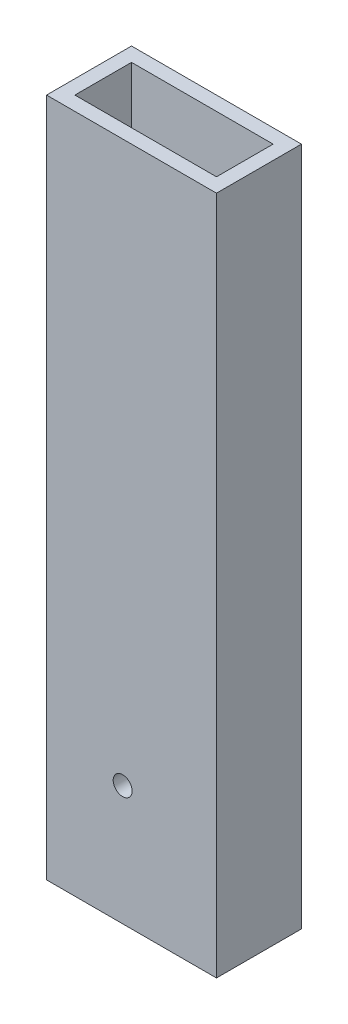
ISO-10303-21;
HEADER;
FILE_DESCRIPTION(('STEP AP214'),'2;1');
FILE_NAME('part.step','',(''),(''),'','','');
FILE_SCHEMA(('AUTOMOTIVE_DESIGN { 1 0 10303 214 1 1 1 1 }'));
ENDSEC;
DATA;
#1=APPLICATION_CONTEXT('core data for automotive mechanical design processes');
#2=APPLICATION_PROTOCOL_DEFINITION('international standard','automotive_design',2000,#1);
#3=PRODUCT_CONTEXT('',#1,'mechanical');
#4=PRODUCT('Part','Part','',(#3));
#5=PRODUCT_RELATED_PRODUCT_CATEGORY('part','',(#4));
#6=PRODUCT_DEFINITION_FORMATION('','',#4);
#7=PRODUCT_DEFINITION_CONTEXT('part definition',#1,'design');
#8=PRODUCT_DEFINITION('design','',#6,#7);
#9=PRODUCT_DEFINITION_SHAPE('','',#8);
#10=(LENGTH_UNIT() NAMED_UNIT(*) SI_UNIT(.MILLI.,.METRE.));
#11=(NAMED_UNIT(*) PLANE_ANGLE_UNIT() SI_UNIT($,.RADIAN.));
#12=(NAMED_UNIT(*) SI_UNIT($,.STERADIAN.) SOLID_ANGLE_UNIT());
#13=UNCERTAINTY_MEASURE_WITH_UNIT(LENGTH_MEASURE(1.E-05),#10,'distance_accuracy_value','');
#14=(GEOMETRIC_REPRESENTATION_CONTEXT(3) GLOBAL_UNCERTAINTY_ASSIGNED_CONTEXT((#13)) GLOBAL_UNIT_ASSIGNED_CONTEXT((#10,
#11,#12)) REPRESENTATION_CONTEXT('',''));
#15=CARTESIAN_POINT('',(0.,0.,0.));
#16=DIRECTION('',(0.,0.,1.));
#17=DIRECTION('',(1.,0.,0.));
#18=AXIS2_PLACEMENT_3D('',#15,#16,#17);
#19=CARTESIAN_POINT('',(0.,152.4,0.));
#20=DIRECTION('',(0.,-1.,0.));
#21=DIRECTION('',(0.,0.,-1.));
#22=AXIS2_PLACEMENT_3D('',#19,#20,#21);
#23=PLANE('',#22);
#24=DIRECTION('',(0.,0.,1.));
#25=VECTOR('',#24,1.);
#26=CARTESIAN_POINT('',(0.,152.4,0.));
#27=LINE('',#26,#25);
#28=CARTESIAN_POINT('',(0.,152.4,-19.05));
#29=VERTEX_POINT('',#28);
#30=CARTESIAN_POINT('',(0.,152.4,0.));
#31=VERTEX_POINT('',#30);
#32=EDGE_CURVE('E137',#29,#31,#27,.T.);
#33=ORIENTED_EDGE('',*,*,#32,.T.);
#34=DIRECTION('',(1.,0.,0.));
#35=VECTOR('',#34,1.);
#36=CARTESIAN_POINT('',(0.,152.4,0.));
#37=LINE('',#36,#35);
#38=CARTESIAN_POINT('',(38.1,152.4,0.));
#39=VERTEX_POINT('',#38);
#40=EDGE_CURVE('E140',#31,#39,#37,.T.);
#41=ORIENTED_EDGE('',*,*,#40,.T.);
#42=DIRECTION('',(0.,0.,-1.));
#43=VECTOR('',#42,1.);
#44=CARTESIAN_POINT('',(38.1,152.4,0.));
#45=LINE('',#44,#43);
#46=CARTESIAN_POINT('',(38.1,152.4,-19.05));
#47=VERTEX_POINT('',#46);
#48=EDGE_CURVE('E143',#39,#47,#45,.T.);
#49=ORIENTED_EDGE('',*,*,#48,.T.);
#50=DIRECTION('',(-1.,0.,0.));
#51=VECTOR('',#50,1.);
#52=CARTESIAN_POINT('',(0.,152.4,-19.05));
#53=LINE('',#52,#51);
#54=EDGE_CURVE('E145',#47,#29,#53,.T.);
#55=ORIENTED_EDGE('',*,*,#54,.T.);
#56=EDGE_LOOP('',(#33,#41,#49,#55));
#57=FACE_BOUND('',#56,.T.);
#58=DIRECTION('',(0.,0.,1.));
#59=VECTOR('',#58,1.);
#60=CARTESIAN_POINT('',(3.175,152.4,-3.175));
#61=LINE('',#60,#59);
#62=CARTESIAN_POINT('',(3.175,152.4,-15.875));
#63=VERTEX_POINT('',#62);
#64=CARTESIAN_POINT('',(3.175,152.4,-3.175));
#65=VERTEX_POINT('',#64);
#66=EDGE_CURVE('E99',#63,#65,#61,.T.);
#67=ORIENTED_EDGE('',*,*,#66,.F.);
#68=DIRECTION('',(-1.,0.,0.));
#69=VECTOR('',#68,1.);
#70=CARTESIAN_POINT('',(3.175,152.4,-15.875));
#71=LINE('',#70,#69);
#72=CARTESIAN_POINT('',(34.925,152.4,-15.875));
#73=VERTEX_POINT('',#72);
#74=EDGE_CURVE('E121',#73,#63,#71,.T.);
#75=ORIENTED_EDGE('',*,*,#74,.F.);
#76=DIRECTION('',(0.,0.,-1.));
#77=VECTOR('',#76,1.);
#78=CARTESIAN_POINT('',(34.925,152.4,-3.175));
#79=LINE('',#78,#77);
#80=CARTESIAN_POINT('',(34.925,152.4,-3.175));
#81=VERTEX_POINT('',#80);
#82=EDGE_CURVE('E119',#81,#73,#79,.T.);
#83=ORIENTED_EDGE('',*,*,#82,.F.);
#84=DIRECTION('',(1.,0.,0.));
#85=VECTOR('',#84,1.);
#86=CARTESIAN_POINT('',(3.175,152.4,-3.175));
#87=LINE('',#86,#85);
#88=EDGE_CURVE('E107',#65,#81,#87,.T.);
#89=ORIENTED_EDGE('',*,*,#88,.F.);
#90=EDGE_LOOP('',(#67,#75,#83,#89));
#91=FACE_BOUND('',#90,.T.);
#92=ADVANCED_FACE('F33',(#57,#91),#23,.F.);
#93=CARTESIAN_POINT('',(0.,0.,0.));
#94=DIRECTION('',(0.,-1.,0.));
#95=DIRECTION('',(0.,0.,-1.));
#96=AXIS2_PLACEMENT_3D('',#93,#94,#95);
#97=PLANE('',#96);
#98=DIRECTION('',(0.,0.,1.));
#99=VECTOR('',#98,1.);
#100=CARTESIAN_POINT('',(0.,0.,0.));
#101=LINE('',#100,#99);
#102=CARTESIAN_POINT('',(0.,0.,-19.05));
#103=VERTEX_POINT('',#102);
#104=CARTESIAN_POINT('',(0.,0.,0.));
#105=VERTEX_POINT('',#104);
#106=EDGE_CURVE('E115',#103,#105,#101,.T.);
#107=ORIENTED_EDGE('',*,*,#106,.F.);
#108=DIRECTION('',(-1.,0.,0.));
#109=VECTOR('',#108,1.);
#110=CARTESIAN_POINT('',(0.,0.,-19.05));
#111=LINE('',#110,#109);
#112=CARTESIAN_POINT('',(38.1,0.,-19.05));
#113=VERTEX_POINT('',#112);
#114=EDGE_CURVE('E141',#113,#103,#111,.T.);
#115=ORIENTED_EDGE('',*,*,#114,.F.);
#116=DIRECTION('',(0.,0.,-1.));
#117=VECTOR('',#116,1.);
#118=CARTESIAN_POINT('',(38.1,0.,0.));
#119=LINE('',#118,#117);
#120=CARTESIAN_POINT('',(38.1,0.,0.));
#121=VERTEX_POINT('',#120);
#122=EDGE_CURVE('E152',#121,#113,#119,.T.);
#123=ORIENTED_EDGE('',*,*,#122,.F.);
#124=DIRECTION('',(1.,0.,0.));
#125=VECTOR('',#124,1.);
#126=CARTESIAN_POINT('',(0.,0.,0.));
#127=LINE('',#126,#125);
#128=EDGE_CURVE('E150',#105,#121,#127,.T.);
#129=ORIENTED_EDGE('',*,*,#128,.F.);
#130=EDGE_LOOP('',(#107,#115,#123,#129));
#131=FACE_BOUND('',#130,.T.);
#132=DIRECTION('',(-1.,0.,0.));
#133=VECTOR('',#132,1.);
#134=CARTESIAN_POINT('',(3.175,0.,-15.875));
#135=LINE('',#134,#133);
#136=CARTESIAN_POINT('',(34.925,0.,-15.875));
#137=VERTEX_POINT('',#136);
#138=CARTESIAN_POINT('',(3.175,0.,-15.875));
#139=VERTEX_POINT('',#138);
#140=EDGE_CURVE('E108',#137,#139,#135,.T.);
#141=ORIENTED_EDGE('',*,*,#140,.T.);
#142=DIRECTION('',(0.,0.,1.));
#143=VECTOR('',#142,1.);
#144=CARTESIAN_POINT('',(3.175,0.,-3.175));
#145=LINE('',#144,#143);
#146=CARTESIAN_POINT('',(3.175,0.,-3.175));
#147=VERTEX_POINT('',#146);
#148=EDGE_CURVE('E57',#139,#147,#145,.T.);
#149=ORIENTED_EDGE('',*,*,#148,.T.);
#150=DIRECTION('',(1.,0.,0.));
#151=VECTOR('',#150,1.);
#152=CARTESIAN_POINT('',(3.175,0.,-3.175));
#153=LINE('',#152,#151);
#154=CARTESIAN_POINT('',(34.925,0.,-3.175));
#155=VERTEX_POINT('',#154);
#156=EDGE_CURVE('E114',#147,#155,#153,.T.);
#157=ORIENTED_EDGE('',*,*,#156,.T.);
#158=DIRECTION('',(0.,0.,-1.));
#159=VECTOR('',#158,1.);
#160=CARTESIAN_POINT('',(34.925,0.,-3.175));
#161=LINE('',#160,#159);
#162=EDGE_CURVE('E129',#155,#137,#161,.T.);
#163=ORIENTED_EDGE('',*,*,#162,.T.);
#164=EDGE_LOOP('',(#141,#149,#157,#163));
#165=FACE_BOUND('',#164,.T.);
#166=ADVANCED_FACE('F171',(#131,#165),#97,.T.);
#167=CARTESIAN_POINT('',(0.,152.4,0.));
#168=DIRECTION('',(1.,0.,0.));
#169=DIRECTION('',(0.,0.,-1.));
#170=AXIS2_PLACEMENT_3D('',#167,#168,#169);
#171=PLANE('',#170);
#172=ORIENTED_EDGE('',*,*,#106,.T.);
#173=DIRECTION('',(0.,-1.,0.));
#174=VECTOR('',#173,1.);
#175=CARTESIAN_POINT('',(0.,152.4,0.));
#176=LINE('',#175,#174);
#177=EDGE_CURVE('E11',#31,#105,#176,.T.);
#178=ORIENTED_EDGE('',*,*,#177,.F.);
#179=ORIENTED_EDGE('',*,*,#32,.F.);
#180=DIRECTION('',(0.,-1.,0.));
#181=VECTOR('',#180,1.);
#182=CARTESIAN_POINT('',(0.,152.4,-19.05));
#183=LINE('',#182,#181);
#184=EDGE_CURVE('E147',#29,#103,#183,.T.);
#185=ORIENTED_EDGE('',*,*,#184,.T.);
#186=EDGE_LOOP('',(#172,#178,#179,#185));
#187=FACE_BOUND('',#186,.T.);
#188=ADVANCED_FACE('F35',(#187),#171,.F.);
#189=CARTESIAN_POINT('',(0.,152.4,0.));
#190=DIRECTION('',(0.,0.,-1.));
#191=DIRECTION('',(-1.,0.,0.));
#192=AXIS2_PLACEMENT_3D('',#189,#190,#191);
#193=PLANE('',#192);
#194=CARTESIAN_POINT('',(17.0622438710398,26.8326796394403,0.));
#195=DIRECTION('',(0.,0.,-1.));
#196=DIRECTION('',(-1.,0.,0.));
#197=AXIS2_PLACEMENT_3D('',#194,#195,#196);
#198=CIRCLE('',#197,2.12500000000001);
#199=CARTESIAN_POINT('',(14.9372438710398,26.8326796394403,0.));
#200=VERTEX_POINT('',#199);
#201=EDGE_CURVE('E208',#200,#200,#198,.T.);
#202=ORIENTED_EDGE('',*,*,#201,.T.);
#203=EDGE_LOOP('',(#202));
#204=FACE_BOUND('',#203,.T.);
#205=ORIENTED_EDGE('',*,*,#128,.T.);
#206=DIRECTION('',(0.,-1.,0.));
#207=VECTOR('',#206,1.);
#208=CARTESIAN_POINT('',(38.1,152.4,0.));
#209=LINE('',#208,#207);
#210=EDGE_CURVE('E42',#39,#121,#209,.T.);
#211=ORIENTED_EDGE('',*,*,#210,.F.);
#212=ORIENTED_EDGE('',*,*,#40,.F.);
#213=ORIENTED_EDGE('',*,*,#177,.T.);
#214=EDGE_LOOP('',(#205,#211,#212,#213));
#215=FACE_BOUND('',#214,.T.);
#216=ADVANCED_FACE('F181',(#204,#215),#193,.F.);
#217=CARTESIAN_POINT('',(38.1,152.4,0.));
#218=DIRECTION('',(-1.,0.,0.));
#219=DIRECTION('',(0.,0.,1.));
#220=AXIS2_PLACEMENT_3D('',#217,#218,#219);
#221=PLANE('',#220);
#222=ORIENTED_EDGE('',*,*,#122,.T.);
#223=DIRECTION('',(0.,-1.,0.));
#224=VECTOR('',#223,1.);
#225=CARTESIAN_POINT('',(38.1,152.4,-19.05));
#226=LINE('',#225,#224);
#227=EDGE_CURVE('E157',#47,#113,#226,.T.);
#228=ORIENTED_EDGE('',*,*,#227,.F.);
#229=ORIENTED_EDGE('',*,*,#48,.F.);
#230=ORIENTED_EDGE('',*,*,#210,.T.);
#231=EDGE_LOOP('',(#222,#228,#229,#230));
#232=FACE_BOUND('',#231,.T.);
#233=ADVANCED_FACE('F165',(#232),#221,.F.);
#234=CARTESIAN_POINT('',(0.,152.4,-19.05));
#235=DIRECTION('',(0.,0.,1.));
#236=DIRECTION('',(1.,0.,0.));
#237=AXIS2_PLACEMENT_3D('',#234,#235,#236);
#238=PLANE('',#237);
#239=CARTESIAN_POINT('',(17.0622438710398,26.8326796394403,-19.05));
#240=DIRECTION('',(0.,0.,-1.));
#241=DIRECTION('',(-1.,0.,0.));
#242=AXIS2_PLACEMENT_3D('',#239,#240,#241);
#243=CIRCLE('',#242,2.12500000000001);
#244=CARTESIAN_POINT('',(14.9372438710398,26.8326796394403,-19.05));
#245=VERTEX_POINT('',#244);
#246=EDGE_CURVE('E206',#245,#245,#243,.T.);
#247=ORIENTED_EDGE('',*,*,#246,.F.);
#248=EDGE_LOOP('',(#247));
#249=FACE_BOUND('',#248,.T.);
#250=ORIENTED_EDGE('',*,*,#114,.T.);
#251=ORIENTED_EDGE('',*,*,#184,.F.);
#252=ORIENTED_EDGE('',*,*,#54,.F.);
#253=ORIENTED_EDGE('',*,*,#227,.T.);
#254=EDGE_LOOP('',(#250,#251,#252,#253));
#255=FACE_BOUND('',#254,.T.);
#256=ADVANCED_FACE('F175',(#249,#255),#238,.F.);
#257=CARTESIAN_POINT('',(3.175,152.4,-3.175));
#258=DIRECTION('',(1.,0.,0.));
#259=DIRECTION('',(0.,0.,-1.));
#260=AXIS2_PLACEMENT_3D('',#257,#258,#259);
#261=PLANE('',#260);
#262=ORIENTED_EDGE('',*,*,#148,.F.);
#263=DIRECTION('',(0.,-1.,0.));
#264=VECTOR('',#263,1.);
#265=CARTESIAN_POINT('',(3.175,152.4,-15.875));
#266=LINE('',#265,#264);
#267=EDGE_CURVE('E103',#63,#139,#266,.T.);
#268=ORIENTED_EDGE('',*,*,#267,.F.);
#269=ORIENTED_EDGE('',*,*,#66,.T.);
#270=DIRECTION('',(0.,-1.,0.));
#271=VECTOR('',#270,1.);
#272=CARTESIAN_POINT('',(3.175,152.4,-3.175));
#273=LINE('',#272,#271);
#274=EDGE_CURVE('E102',#65,#147,#273,.T.);
#275=ORIENTED_EDGE('',*,*,#274,.T.);
#276=EDGE_LOOP('',(#262,#268,#269,#275));
#277=FACE_BOUND('',#276,.T.);
#278=ADVANCED_FACE('F101',(#277),#261,.T.);
#279=CARTESIAN_POINT('',(3.175,152.4,-3.175));
#280=DIRECTION('',(0.,0.,-1.));
#281=DIRECTION('',(-1.,0.,0.));
#282=AXIS2_PLACEMENT_3D('',#279,#280,#281);
#283=PLANE('',#282);
#284=CARTESIAN_POINT('',(17.0622438710398,26.8326796394403,-3.175));
#285=DIRECTION('',(0.,0.,-1.));
#286=DIRECTION('',(-1.,0.,0.));
#287=AXIS2_PLACEMENT_3D('',#284,#285,#286);
#288=CIRCLE('',#287,2.12500000000001);
#289=CARTESIAN_POINT('',(14.9372438710398,26.8326796394403,-3.175));
#290=VERTEX_POINT('',#289);
#291=EDGE_CURVE('E127',#290,#290,#288,.T.);
#292=ORIENTED_EDGE('',*,*,#291,.F.);
#293=EDGE_LOOP('',(#292));
#294=FACE_BOUND('',#293,.T.);
#295=ORIENTED_EDGE('',*,*,#156,.F.);
#296=ORIENTED_EDGE('',*,*,#274,.F.);
#297=ORIENTED_EDGE('',*,*,#88,.T.);
#298=DIRECTION('',(0.,-1.,0.));
#299=VECTOR('',#298,1.);
#300=CARTESIAN_POINT('',(34.925,152.4,-3.175));
#301=LINE('',#300,#299);
#302=EDGE_CURVE('E116',#81,#155,#301,.T.);
#303=ORIENTED_EDGE('',*,*,#302,.T.);
#304=EDGE_LOOP('',(#295,#296,#297,#303));
#305=FACE_BOUND('',#304,.T.);
#306=ADVANCED_FACE('F111',(#294,#305),#283,.T.);
#307=CARTESIAN_POINT('',(34.925,152.4,-3.175));
#308=DIRECTION('',(-1.,0.,0.));
#309=DIRECTION('',(0.,0.,1.));
#310=AXIS2_PLACEMENT_3D('',#307,#308,#309);
#311=PLANE('',#310);
#312=ORIENTED_EDGE('',*,*,#162,.F.);
#313=ORIENTED_EDGE('',*,*,#302,.F.);
#314=ORIENTED_EDGE('',*,*,#82,.T.);
#315=DIRECTION('',(0.,-1.,0.));
#316=VECTOR('',#315,1.);
#317=CARTESIAN_POINT('',(34.925,152.4,-15.875));
#318=LINE('',#317,#316);
#319=EDGE_CURVE('E49',#73,#137,#318,.T.);
#320=ORIENTED_EDGE('',*,*,#319,.T.);
#321=EDGE_LOOP('',(#312,#313,#314,#320));
#322=FACE_BOUND('',#321,.T.);
#323=ADVANCED_FACE('F221',(#322),#311,.T.);
#324=CARTESIAN_POINT('',(3.175,152.4,-15.875));
#325=DIRECTION('',(0.,0.,1.));
#326=DIRECTION('',(1.,0.,0.));
#327=AXIS2_PLACEMENT_3D('',#324,#325,#326);
#328=PLANE('',#327);
#329=CARTESIAN_POINT('',(17.0622438710398,26.8326796394403,-15.875));
#330=DIRECTION('',(0.,0.,1.));
#331=DIRECTION('',(1.,0.,0.));
#332=AXIS2_PLACEMENT_3D('',#329,#330,#331);
#333=CIRCLE('',#332,2.12500000000001);
#334=CARTESIAN_POINT('',(19.1872438710398,26.8326796394403,-15.875));
#335=VERTEX_POINT('',#334);
#336=EDGE_CURVE('E37',#335,#335,#333,.T.);
#337=ORIENTED_EDGE('',*,*,#336,.F.);
#338=EDGE_LOOP('',(#337));
#339=FACE_BOUND('',#338,.T.);
#340=ORIENTED_EDGE('',*,*,#140,.F.);
#341=ORIENTED_EDGE('',*,*,#319,.F.);
#342=ORIENTED_EDGE('',*,*,#74,.T.);
#343=ORIENTED_EDGE('',*,*,#267,.T.);
#344=EDGE_LOOP('',(#340,#341,#342,#343));
#345=FACE_BOUND('',#344,.T.);
#346=ADVANCED_FACE('F219',(#339,#345),#328,.T.);
#347=CARTESIAN_POINT('',(17.0622438710398,26.8326796394403,0.));
#348=DIRECTION('',(0.,0.,-1.));
#349=DIRECTION('',(-1.,0.,0.));
#350=AXIS2_PLACEMENT_3D('',#347,#348,#349);
#351=CYLINDRICAL_SURFACE('',#350,2.12500000000001);
#352=ORIENTED_EDGE('',*,*,#336,.T.);
#353=EDGE_LOOP('',(#352));
#354=FACE_BOUND('',#353,.T.);
#355=ORIENTED_EDGE('',*,*,#246,.T.);
#356=EDGE_LOOP('',(#355));
#357=FACE_BOUND('',#356,.T.);
#358=ADVANCED_FACE('F217',(#354,#357),#351,.F.);
#359=ORIENTED_EDGE('',*,*,#291,.T.);
#360=EDGE_LOOP('',(#359));
#361=FACE_BOUND('',#360,.T.);
#362=ORIENTED_EDGE('',*,*,#201,.F.);
#363=EDGE_LOOP('',(#362));
#364=FACE_BOUND('',#363,.T.);
#365=ADVANCED_FACE('F233',(#361,#364),#351,.F.);
#366=CLOSED_SHELL('',(#92,#166,#188,#216,#233,#256,#278,#306,#323,#346,#358,#365));
#367=MANIFOLD_SOLID_BREP('B2',#366);
#368=ADVANCED_BREP_SHAPE_REPRESENTATION('',(#18,#367),#14);
#369=SHAPE_DEFINITION_REPRESENTATION(#9,#368);
ENDSEC;
END-ISO-10303-21;
